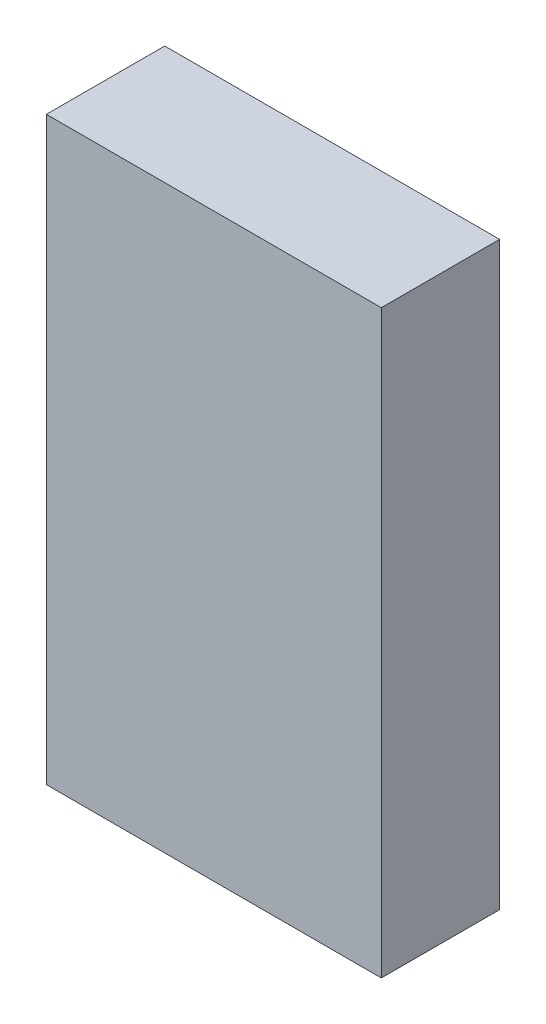
ISO-10303-21;
HEADER;
FILE_DESCRIPTION(('STEP AP214'),'2;1');
FILE_NAME('part.step','',(''),(''),'','','');
FILE_SCHEMA(('AUTOMOTIVE_DESIGN { 1 0 10303 214 1 1 1 1 }'));
ENDSEC;
DATA;
#1=APPLICATION_CONTEXT('core data for automotive mechanical design processes');
#2=APPLICATION_PROTOCOL_DEFINITION('international standard','automotive_design',2000,#1);
#3=PRODUCT_CONTEXT('',#1,'mechanical');
#4=PRODUCT('Part','Part','',(#3));
#5=PRODUCT_RELATED_PRODUCT_CATEGORY('part','',(#4));
#6=PRODUCT_DEFINITION_FORMATION('','',#4);
#7=PRODUCT_DEFINITION_CONTEXT('part definition',#1,'design');
#8=PRODUCT_DEFINITION('design','',#6,#7);
#9=PRODUCT_DEFINITION_SHAPE('','',#8);
#10=(LENGTH_UNIT() NAMED_UNIT(*) SI_UNIT(.MILLI.,.METRE.));
#11=(NAMED_UNIT(*) PLANE_ANGLE_UNIT() SI_UNIT($,.RADIAN.));
#12=(NAMED_UNIT(*) SI_UNIT($,.STERADIAN.) SOLID_ANGLE_UNIT());
#13=UNCERTAINTY_MEASURE_WITH_UNIT(LENGTH_MEASURE(1.E-05),#10,'distance_accuracy_value','');
#14=(GEOMETRIC_REPRESENTATION_CONTEXT(3) GLOBAL_UNCERTAINTY_ASSIGNED_CONTEXT((#13)) GLOBAL_UNIT_ASSIGNED_CONTEXT((#10,
#11,#12)) REPRESENTATION_CONTEXT('',''));
#15=CARTESIAN_POINT('',(0.,0.,0.));
#16=DIRECTION('',(0.,0.,1.));
#17=DIRECTION('',(1.,0.,0.));
#18=AXIS2_PLACEMENT_3D('',#15,#16,#17);
#19=CARTESIAN_POINT('',(3.75000012,6.4999997,2.64999978));
#20=DIRECTION('',(0.,0.,-1.));
#21=DIRECTION('',(-1.,0.,0.));
#22=AXIS2_PLACEMENT_3D('',#19,#20,#21);
#23=PLANE('',#22);
#24=DIRECTION('',(0.,1.,0.));
#25=VECTOR('',#24,1.);
#26=CARTESIAN_POINT('',(-3.75000012,6.4999997,2.64999978));
#27=LINE('',#26,#25);
#28=CARTESIAN_POINT('',(-3.75000012,6.4999997,2.64999978));
#29=VERTEX_POINT('',#28);
#30=CARTESIAN_POINT('',(-3.75000012,-6.4999997,2.64999978));
#31=VERTEX_POINT('',#30);
#32=EDGE_CURVE('E55',#29,#31,#27,.F.);
#33=ORIENTED_EDGE('',*,*,#32,.T.);
#34=DIRECTION('',(1.,0.,0.));
#35=VECTOR('',#34,1.);
#36=CARTESIAN_POINT('',(-3.75000012,-6.4999997,2.64999978));
#37=LINE('',#36,#35);
#38=CARTESIAN_POINT('',(3.75000012,-6.4999997,2.64999978));
#39=VERTEX_POINT('',#38);
#40=EDGE_CURVE('E57',#31,#39,#37,.T.);
#41=ORIENTED_EDGE('',*,*,#40,.T.);
#42=DIRECTION('',(0.,1.,0.));
#43=VECTOR('',#42,1.);
#44=CARTESIAN_POINT('',(3.75000012,-6.4999997,2.64999978));
#45=LINE('',#44,#43);
#46=CARTESIAN_POINT('',(3.75000012,6.4999997,2.64999978));
#47=VERTEX_POINT('',#46);
#48=EDGE_CURVE('E20',#39,#47,#45,.T.);
#49=ORIENTED_EDGE('',*,*,#48,.T.);
#50=DIRECTION('',(1.,0.,0.));
#51=VECTOR('',#50,1.);
#52=CARTESIAN_POINT('',(3.75000012,6.4999997,2.64999978));
#53=LINE('',#52,#51);
#54=EDGE_CURVE('E80',#47,#29,#53,.F.);
#55=ORIENTED_EDGE('',*,*,#54,.T.);
#56=EDGE_LOOP('',(#33,#41,#49,#55));
#57=FACE_BOUND('',#56,.T.);
#58=ADVANCED_FACE('F17',(#57),#23,.F.);
#59=CARTESIAN_POINT('',(3.75000012,-6.4999997,0.));
#60=DIRECTION('',(-1.,0.,0.));
#61=DIRECTION('',(0.,0.,1.));
#62=AXIS2_PLACEMENT_3D('',#59,#60,#61);
#63=PLANE('',#62);
#64=DIRECTION('',(0.,0.,-1.));
#65=VECTOR('',#64,1.);
#66=CARTESIAN_POINT('',(3.75000012,6.4999997,0.));
#67=LINE('',#66,#65);
#68=CARTESIAN_POINT('',(3.75000012,6.4999997,0.));
#69=VERTEX_POINT('',#68);
#70=EDGE_CURVE('E68',#69,#47,#67,.F.);
#71=ORIENTED_EDGE('',*,*,#70,.T.);
#72=ORIENTED_EDGE('',*,*,#48,.F.);
#73=DIRECTION('',(0.,0.,1.));
#74=VECTOR('',#73,1.);
#75=CARTESIAN_POINT('',(3.75000012,-6.4999997,0.));
#76=LINE('',#75,#74);
#77=CARTESIAN_POINT('',(3.75000012,-6.4999997,0.));
#78=VERTEX_POINT('',#77);
#79=EDGE_CURVE('E63',#39,#78,#76,.F.);
#80=ORIENTED_EDGE('',*,*,#79,.T.);
#81=DIRECTION('',(0.,1.,0.));
#82=VECTOR('',#81,1.);
#83=CARTESIAN_POINT('',(3.75000012,6.4999997,0.));
#84=LINE('',#83,#82);
#85=EDGE_CURVE('E83',#69,#78,#84,.F.);
#86=ORIENTED_EDGE('',*,*,#85,.F.);
#87=EDGE_LOOP('',(#71,#72,#80,#86));
#88=FACE_BOUND('',#87,.T.);
#89=ADVANCED_FACE('F65',(#88),#63,.F.);
#90=CARTESIAN_POINT('',(-3.75000012,-6.4999997,0.));
#91=DIRECTION('',(0.,1.,0.));
#92=DIRECTION('',(0.,0.,1.));
#93=AXIS2_PLACEMENT_3D('',#90,#91,#92);
#94=PLANE('',#93);
#95=ORIENTED_EDGE('',*,*,#79,.F.);
#96=ORIENTED_EDGE('',*,*,#40,.F.);
#97=DIRECTION('',(0.,0.,-1.));
#98=VECTOR('',#97,1.);
#99=CARTESIAN_POINT('',(-3.75000012,-6.4999997,0.));
#100=LINE('',#99,#98);
#101=CARTESIAN_POINT('',(-3.75000012,-6.4999997,0.));
#102=VERTEX_POINT('',#101);
#103=EDGE_CURVE('E75',#31,#102,#100,.T.);
#104=ORIENTED_EDGE('',*,*,#103,.T.);
#105=DIRECTION('',(-1.,0.,0.));
#106=VECTOR('',#105,1.);
#107=CARTESIAN_POINT('',(3.75000012,-6.4999997,0.));
#108=LINE('',#107,#106);
#109=EDGE_CURVE('E72',#78,#102,#108,.T.);
#110=ORIENTED_EDGE('',*,*,#109,.F.);
#111=EDGE_LOOP('',(#95,#96,#104,#110));
#112=FACE_BOUND('',#111,.T.);
#113=ADVANCED_FACE('F70',(#112),#94,.F.);
#114=CARTESIAN_POINT('',(-3.75000012,6.4999997,0.));
#115=DIRECTION('',(1.,0.,0.));
#116=DIRECTION('',(0.,0.,-1.));
#117=AXIS2_PLACEMENT_3D('',#114,#115,#116);
#118=PLANE('',#117);
#119=ORIENTED_EDGE('',*,*,#103,.F.);
#120=ORIENTED_EDGE('',*,*,#32,.F.);
#121=DIRECTION('',(0.,0.,-1.));
#122=VECTOR('',#121,1.);
#123=CARTESIAN_POINT('',(-3.75000012,6.4999997,0.));
#124=LINE('',#123,#122);
#125=CARTESIAN_POINT('',(-3.75000012,6.4999997,0.));
#126=VERTEX_POINT('',#125);
#127=EDGE_CURVE('E35',#29,#126,#124,.T.);
#128=ORIENTED_EDGE('',*,*,#127,.T.);
#129=DIRECTION('',(0.,1.,0.));
#130=VECTOR('',#129,1.);
#131=CARTESIAN_POINT('',(-3.75000012,6.4999997,0.));
#132=LINE('',#131,#130);
#133=EDGE_CURVE('E26',#102,#126,#132,.T.);
#134=ORIENTED_EDGE('',*,*,#133,.F.);
#135=EDGE_LOOP('',(#119,#120,#128,#134));
#136=FACE_BOUND('',#135,.T.);
#137=ADVANCED_FACE('F89',(#136),#118,.F.);
#138=CARTESIAN_POINT('',(3.75000012,6.4999997,0.));
#139=DIRECTION('',(0.,-1.,0.));
#140=DIRECTION('',(0.,0.,-1.));
#141=AXIS2_PLACEMENT_3D('',#138,#139,#140);
#142=PLANE('',#141);
#143=ORIENTED_EDGE('',*,*,#127,.F.);
#144=ORIENTED_EDGE('',*,*,#54,.F.);
#145=ORIENTED_EDGE('',*,*,#70,.F.);
#146=DIRECTION('',(-1.,0.,0.));
#147=VECTOR('',#146,1.);
#148=CARTESIAN_POINT('',(3.75000012,6.4999997,0.));
#149=LINE('',#148,#147);
#150=EDGE_CURVE('E11',#126,#69,#149,.F.);
#151=ORIENTED_EDGE('',*,*,#150,.F.);
#152=EDGE_LOOP('',(#143,#144,#145,#151));
#153=FACE_BOUND('',#152,.T.);
#154=ADVANCED_FACE('F91',(#153),#142,.F.);
#155=CARTESIAN_POINT('',(3.75000012,6.4999997,0.));
#156=DIRECTION('',(0.,0.,-1.));
#157=DIRECTION('',(-1.,0.,0.));
#158=AXIS2_PLACEMENT_3D('',#155,#156,#157);
#159=PLANE('',#158);
#160=ORIENTED_EDGE('',*,*,#133,.T.);
#161=ORIENTED_EDGE('',*,*,#150,.T.);
#162=ORIENTED_EDGE('',*,*,#85,.T.);
#163=ORIENTED_EDGE('',*,*,#109,.T.);
#164=EDGE_LOOP('',(#160,#161,#162,#163));
#165=FACE_BOUND('',#164,.T.);
#166=ADVANCED_FACE('F88',(#165),#159,.T.);
#167=CLOSED_SHELL('',(#58,#89,#113,#137,#154,#166));
#168=MANIFOLD_SOLID_BREP('B1',#167);
#169=ADVANCED_BREP_SHAPE_REPRESENTATION('',(#18,#168),#14);
#170=SHAPE_DEFINITION_REPRESENTATION(#9,#169);
ENDSEC;
END-ISO-10303-21;
